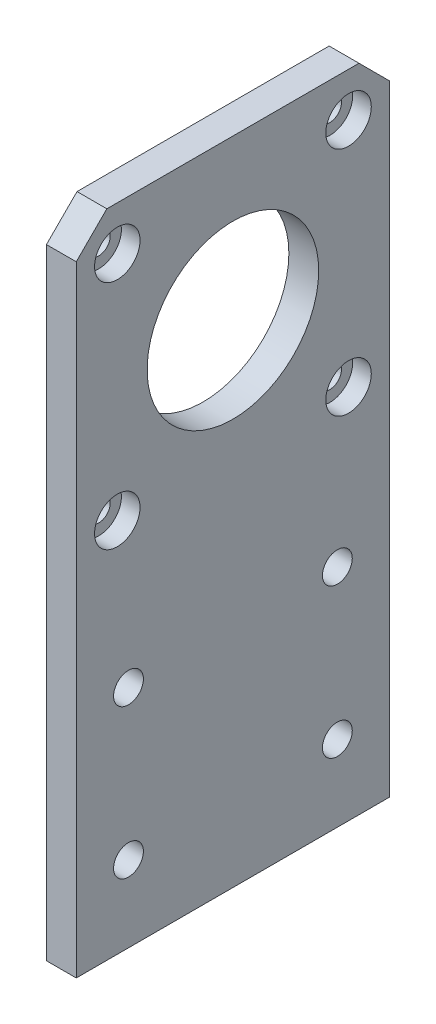
ISO-10303-21;
HEADER;
FILE_DESCRIPTION(('STEP AP214'),'2;1');
FILE_NAME('part.step','',(''),(''),'','','');
FILE_SCHEMA(('AUTOMOTIVE_DESIGN { 1 0 10303 214 1 1 1 1 }'));
ENDSEC;
DATA;
#1=APPLICATION_CONTEXT('core data for automotive mechanical design processes');
#2=APPLICATION_PROTOCOL_DEFINITION('international standard','automotive_design',2000,#1);
#3=PRODUCT_CONTEXT('',#1,'mechanical');
#4=PRODUCT('Part','Part','',(#3));
#5=PRODUCT_RELATED_PRODUCT_CATEGORY('part','',(#4));
#6=PRODUCT_DEFINITION_FORMATION('','',#4);
#7=PRODUCT_DEFINITION_CONTEXT('part definition',#1,'design');
#8=PRODUCT_DEFINITION('design','',#6,#7);
#9=PRODUCT_DEFINITION_SHAPE('','',#8);
#10=(LENGTH_UNIT() NAMED_UNIT(*) SI_UNIT(.MILLI.,.METRE.));
#11=(NAMED_UNIT(*) PLANE_ANGLE_UNIT() SI_UNIT($,.RADIAN.));
#12=(NAMED_UNIT(*) SI_UNIT($,.STERADIAN.) SOLID_ANGLE_UNIT());
#13=UNCERTAINTY_MEASURE_WITH_UNIT(LENGTH_MEASURE(1.E-05),#10,'distance_accuracy_value','');
#14=(GEOMETRIC_REPRESENTATION_CONTEXT(3) GLOBAL_UNCERTAINTY_ASSIGNED_CONTEXT((#13)) GLOBAL_UNIT_ASSIGNED_CONTEXT((#10,
#11,#12)) REPRESENTATION_CONTEXT('',''));
#15=CARTESIAN_POINT('',(0.,0.,0.));
#16=DIRECTION('',(0.,0.,1.));
#17=DIRECTION('',(1.,0.,0.));
#18=AXIS2_PLACEMENT_3D('',#15,#16,#17);
#19=CARTESIAN_POINT('',(0.,6.74500000000001,-15.5));
#20=DIRECTION('',(1.,0.,0.));
#21=DIRECTION('',(0.,0.,-1.));
#22=AXIS2_PLACEMENT_3D('',#19,#20,#21);
#23=CYLINDRICAL_SURFACE('',#22,1.55);
#24=CARTESIAN_POINT('',(0.,6.74500000000001,-15.5));
#25=DIRECTION('',(1.,0.,0.));
#26=DIRECTION('',(0.,0.,-1.));
#27=AXIS2_PLACEMENT_3D('',#24,#25,#26);
#28=CIRCLE('',#27,1.55);
#29=CARTESIAN_POINT('',(0.,6.74500000000001,-17.05));
#30=VERTEX_POINT('',#29);
#31=EDGE_CURVE('E200',#30,#30,#28,.T.);
#32=ORIENTED_EDGE('',*,*,#31,.F.);
#33=EDGE_LOOP('',(#32));
#34=FACE_BOUND('',#33,.T.);
#35=CARTESIAN_POINT('',(1.5,6.74500000000001,-15.5));
#36=DIRECTION('',(1.,0.,0.));
#37=DIRECTION('',(0.,0.,-1.));
#38=AXIS2_PLACEMENT_3D('',#35,#36,#37);
#39=CIRCLE('',#38,1.55);
#40=CARTESIAN_POINT('',(1.5,6.74500000000001,-17.05));
#41=VERTEX_POINT('',#40);
#42=EDGE_CURVE('E36',#41,#41,#39,.F.);
#43=ORIENTED_EDGE('',*,*,#42,.F.);
#44=EDGE_LOOP('',(#43));
#45=FACE_BOUND('',#44,.T.);
#46=ADVANCED_FACE('F32',(#34,#45),#23,.F.);
#47=CARTESIAN_POINT('',(0.,6.74500000000001,15.5));
#48=DIRECTION('',(1.,0.,0.));
#49=DIRECTION('',(0.,0.,-1.));
#50=AXIS2_PLACEMENT_3D('',#47,#48,#49);
#51=CYLINDRICAL_SURFACE('',#50,1.55);
#52=CARTESIAN_POINT('',(0.,6.74500000000001,15.5));
#53=DIRECTION('',(1.,0.,0.));
#54=DIRECTION('',(0.,0.,-1.));
#55=AXIS2_PLACEMENT_3D('',#52,#53,#54);
#56=CIRCLE('',#55,1.55);
#57=CARTESIAN_POINT('',(0.,6.74500000000001,13.95));
#58=VERTEX_POINT('',#57);
#59=EDGE_CURVE('E195',#58,#58,#56,.T.);
#60=ORIENTED_EDGE('',*,*,#59,.F.);
#61=EDGE_LOOP('',(#60));
#62=FACE_BOUND('',#61,.T.);
#63=CARTESIAN_POINT('',(1.5,6.74500000000001,15.5));
#64=DIRECTION('',(1.,0.,0.));
#65=DIRECTION('',(0.,0.,-1.));
#66=AXIS2_PLACEMENT_3D('',#63,#64,#65);
#67=CIRCLE('',#66,1.55);
#68=CARTESIAN_POINT('',(1.5,6.74500000000001,13.95));
#69=VERTEX_POINT('',#68);
#70=EDGE_CURVE('E143',#69,#69,#67,.F.);
#71=ORIENTED_EDGE('',*,*,#70,.F.);
#72=EDGE_LOOP('',(#71));
#73=FACE_BOUND('',#72,.T.);
#74=ADVANCED_FACE('F232',(#62,#73),#51,.F.);
#75=CARTESIAN_POINT('',(0.,37.745,15.5));
#76=DIRECTION('',(1.,0.,0.));
#77=DIRECTION('',(0.,0.,-1.));
#78=AXIS2_PLACEMENT_3D('',#75,#76,#77);
#79=CYLINDRICAL_SURFACE('',#78,1.55);
#80=CARTESIAN_POINT('',(0.,37.745,15.5));
#81=DIRECTION('',(1.,0.,0.));
#82=DIRECTION('',(0.,0.,-1.));
#83=AXIS2_PLACEMENT_3D('',#80,#81,#82);
#84=CIRCLE('',#83,1.55);
#85=CARTESIAN_POINT('',(0.,37.745,13.95));
#86=VERTEX_POINT('',#85);
#87=EDGE_CURVE('E116',#86,#86,#84,.T.);
#88=ORIENTED_EDGE('',*,*,#87,.F.);
#89=EDGE_LOOP('',(#88));
#90=FACE_BOUND('',#89,.T.);
#91=CARTESIAN_POINT('',(1.5,37.745,15.5));
#92=DIRECTION('',(1.,0.,0.));
#93=DIRECTION('',(0.,0.,-1.));
#94=AXIS2_PLACEMENT_3D('',#91,#92,#93);
#95=CIRCLE('',#94,1.55);
#96=CARTESIAN_POINT('',(1.5,37.745,13.95));
#97=VERTEX_POINT('',#96);
#98=EDGE_CURVE('E139',#97,#97,#95,.F.);
#99=ORIENTED_EDGE('',*,*,#98,.F.);
#100=EDGE_LOOP('',(#99));
#101=FACE_BOUND('',#100,.T.);
#102=ADVANCED_FACE('F238',(#90,#101),#79,.F.);
#103=CARTESIAN_POINT('',(0.,37.745,-15.5));
#104=DIRECTION('',(1.,0.,0.));
#105=DIRECTION('',(0.,0.,-1.));
#106=AXIS2_PLACEMENT_3D('',#103,#104,#105);
#107=CYLINDRICAL_SURFACE('',#106,1.55);
#108=CARTESIAN_POINT('',(0.,37.745,-15.5));
#109=DIRECTION('',(1.,0.,0.));
#110=DIRECTION('',(0.,0.,-1.));
#111=AXIS2_PLACEMENT_3D('',#108,#109,#110);
#112=CIRCLE('',#111,1.55);
#113=CARTESIAN_POINT('',(0.,37.745,-17.05));
#114=VERTEX_POINT('',#113);
#115=EDGE_CURVE('E203',#114,#114,#112,.T.);
#116=ORIENTED_EDGE('',*,*,#115,.F.);
#117=EDGE_LOOP('',(#116));
#118=FACE_BOUND('',#117,.T.);
#119=CARTESIAN_POINT('',(1.5,37.745,-15.5));
#120=DIRECTION('',(1.,0.,0.));
#121=DIRECTION('',(0.,0.,-1.));
#122=AXIS2_PLACEMENT_3D('',#119,#120,#121);
#123=CIRCLE('',#122,1.55);
#124=CARTESIAN_POINT('',(1.5,37.745,-17.05));
#125=VERTEX_POINT('',#124);
#126=EDGE_CURVE('E134',#125,#125,#123,.F.);
#127=ORIENTED_EDGE('',*,*,#126,.F.);
#128=EDGE_LOOP('',(#127));
#129=FACE_BOUND('',#128,.T.);
#130=ADVANCED_FACE('F229',(#118,#129),#107,.F.);
#131=CARTESIAN_POINT('',(4.,-43.625,-21.));
#132=DIRECTION('',(0.,0.,1.));
#133=DIRECTION('',(1.,0.,0.));
#134=AXIS2_PLACEMENT_3D('',#131,#132,#133);
#135=PLANE('',#134);
#136=DIRECTION('',(0.,1.,0.));
#137=VECTOR('',#136,1.);
#138=CARTESIAN_POINT('',(0.,-43.625,-21.));
#139=LINE('',#138,#137);
#140=CARTESIAN_POINT('',(0.,-43.625,-21.));
#141=VERTEX_POINT('',#140);
#142=CARTESIAN_POINT('',(0.,39.525,-21.));
#143=VERTEX_POINT('',#142);
#144=EDGE_CURVE('E113',#141,#143,#139,.T.);
#145=ORIENTED_EDGE('',*,*,#144,.T.);
#146=DIRECTION('',(1.,0.,0.));
#147=VECTOR('',#146,1.);
#148=CARTESIAN_POINT('',(4.,39.525,-21.));
#149=LINE('',#148,#147);
#150=CARTESIAN_POINT('',(4.,39.525,-21.));
#151=VERTEX_POINT('',#150);
#152=EDGE_CURVE('E57',#143,#151,#149,.T.);
#153=ORIENTED_EDGE('',*,*,#152,.T.);
#154=DIRECTION('',(0.,1.,0.));
#155=VECTOR('',#154,1.);
#156=CARTESIAN_POINT('',(4.,-43.625,-21.));
#157=LINE('',#156,#155);
#158=CARTESIAN_POINT('',(4.,-43.625,-21.));
#159=VERTEX_POINT('',#158);
#160=EDGE_CURVE('E121',#159,#151,#157,.T.);
#161=ORIENTED_EDGE('',*,*,#160,.F.);
#162=DIRECTION('',(-1.,0.,0.));
#163=VECTOR('',#162,1.);
#164=CARTESIAN_POINT('',(4.,-43.625,-21.));
#165=LINE('',#164,#163);
#166=EDGE_CURVE('E105',#159,#141,#165,.T.);
#167=ORIENTED_EDGE('',*,*,#166,.T.);
#168=EDGE_LOOP('',(#145,#153,#161,#167));
#169=FACE_BOUND('',#168,.T.);
#170=ADVANCED_FACE('F218',(#169),#135,.F.);
#171=CARTESIAN_POINT('',(4.,43.625,21.));
#172=DIRECTION('',(0.,-1.,0.));
#173=DIRECTION('',(0.,0.,-1.));
#174=AXIS2_PLACEMENT_3D('',#171,#172,#173);
#175=PLANE('',#174);
#176=DIRECTION('',(0.,0.,1.));
#177=VECTOR('',#176,1.);
#178=CARTESIAN_POINT('',(4.,43.625,21.));
#179=LINE('',#178,#177);
#180=CARTESIAN_POINT('',(4.,43.625,-16.9));
#181=VERTEX_POINT('',#180);
#182=CARTESIAN_POINT('',(4.,43.625,16.9));
#183=VERTEX_POINT('',#182);
#184=EDGE_CURVE('E95',#181,#183,#179,.T.);
#185=ORIENTED_EDGE('',*,*,#184,.F.);
#186=DIRECTION('',(-1.,0.,0.));
#187=VECTOR('',#186,1.);
#188=CARTESIAN_POINT('',(4.,43.625,-16.9));
#189=LINE('',#188,#187);
#190=CARTESIAN_POINT('',(0.,43.625,-16.9));
#191=VERTEX_POINT('',#190);
#192=EDGE_CURVE('E124',#181,#191,#189,.T.);
#193=ORIENTED_EDGE('',*,*,#192,.T.);
#194=DIRECTION('',(0.,0.,1.));
#195=VECTOR('',#194,1.);
#196=CARTESIAN_POINT('',(0.,43.625,21.));
#197=LINE('',#196,#195);
#198=CARTESIAN_POINT('',(0.,43.625,16.9));
#199=VERTEX_POINT('',#198);
#200=EDGE_CURVE('E115',#191,#199,#197,.T.);
#201=ORIENTED_EDGE('',*,*,#200,.T.);
#202=DIRECTION('',(1.,0.,0.));
#203=VECTOR('',#202,1.);
#204=CARTESIAN_POINT('',(4.,43.625,16.9));
#205=LINE('',#204,#203);
#206=EDGE_CURVE('E104',#199,#183,#205,.T.);
#207=ORIENTED_EDGE('',*,*,#206,.T.);
#208=EDGE_LOOP('',(#185,#193,#201,#207));
#209=FACE_BOUND('',#208,.T.);
#210=ADVANCED_FACE('F221',(#209),#175,.F.);
#211=CARTESIAN_POINT('',(4.,-43.625,21.));
#212=DIRECTION('',(0.,0.,-1.));
#213=DIRECTION('',(-1.,0.,0.));
#214=AXIS2_PLACEMENT_3D('',#211,#212,#213);
#215=PLANE('',#214);
#216=DIRECTION('',(0.,-1.,0.));
#217=VECTOR('',#216,1.);
#218=CARTESIAN_POINT('',(4.,-43.625,21.));
#219=LINE('',#218,#217);
#220=CARTESIAN_POINT('',(4.,39.525,21.));
#221=VERTEX_POINT('',#220);
#222=CARTESIAN_POINT('',(4.,-43.625,21.));
#223=VERTEX_POINT('',#222);
#224=EDGE_CURVE('E87',#221,#223,#219,.T.);
#225=ORIENTED_EDGE('',*,*,#224,.F.);
#226=DIRECTION('',(-1.,0.,0.));
#227=VECTOR('',#226,1.);
#228=CARTESIAN_POINT('',(4.,39.525,21.));
#229=LINE('',#228,#227);
#230=CARTESIAN_POINT('',(0.,39.525,21.));
#231=VERTEX_POINT('',#230);
#232=EDGE_CURVE('E11',#221,#231,#229,.T.);
#233=ORIENTED_EDGE('',*,*,#232,.T.);
#234=DIRECTION('',(0.,-1.,0.));
#235=VECTOR('',#234,1.);
#236=CARTESIAN_POINT('',(0.,-43.625,21.));
#237=LINE('',#236,#235);
#238=CARTESIAN_POINT('',(0.,-43.625,21.));
#239=VERTEX_POINT('',#238);
#240=EDGE_CURVE('E101',#231,#239,#237,.T.);
#241=ORIENTED_EDGE('',*,*,#240,.T.);
#242=DIRECTION('',(-1.,0.,0.));
#243=VECTOR('',#242,1.);
#244=CARTESIAN_POINT('',(4.,-43.625,21.));
#245=LINE('',#244,#243);
#246=EDGE_CURVE('E98',#223,#239,#245,.T.);
#247=ORIENTED_EDGE('',*,*,#246,.F.);
#248=EDGE_LOOP('',(#225,#233,#241,#247));
#249=FACE_BOUND('',#248,.T.);
#250=ADVANCED_FACE('F99',(#249),#215,.F.);
#251=CARTESIAN_POINT('',(4.,-43.625,21.));
#252=DIRECTION('',(0.,1.,0.));
#253=DIRECTION('',(0.,0.,1.));
#254=AXIS2_PLACEMENT_3D('',#251,#252,#253);
#255=PLANE('',#254);
#256=DIRECTION('',(0.,0.,-1.));
#257=VECTOR('',#256,1.);
#258=CARTESIAN_POINT('',(0.,-43.625,21.));
#259=LINE('',#258,#257);
#260=EDGE_CURVE('E120',#239,#141,#259,.T.);
#261=ORIENTED_EDGE('',*,*,#260,.T.);
#262=ORIENTED_EDGE('',*,*,#166,.F.);
#263=DIRECTION('',(0.,0.,-1.));
#264=VECTOR('',#263,1.);
#265=CARTESIAN_POINT('',(4.,-43.625,21.));
#266=LINE('',#265,#264);
#267=EDGE_CURVE('E91',#223,#159,#266,.T.);
#268=ORIENTED_EDGE('',*,*,#267,.F.);
#269=ORIENTED_EDGE('',*,*,#246,.T.);
#270=EDGE_LOOP('',(#261,#262,#268,#269));
#271=FACE_BOUND('',#270,.T.);
#272=ADVANCED_FACE('F107',(#271),#255,.F.);
#273=CARTESIAN_POINT('',(4.,0.,0.));
#274=DIRECTION('',(-1.,0.,0.));
#275=DIRECTION('',(0.,0.,1.));
#276=AXIS2_PLACEMENT_3D('',#273,#274,#275);
#277=PLANE('',#276);
#278=CARTESIAN_POINT('',(4.,6.74500000000001,-15.5));
#279=DIRECTION('',(1.,0.,0.));
#280=DIRECTION('',(0.,0.,-1.));
#281=AXIS2_PLACEMENT_3D('',#278,#279,#280);
#282=CIRCLE('',#281,3.05);
#283=CARTESIAN_POINT('',(4.,6.74500000000001,-18.55));
#284=VERTEX_POINT('',#283);
#285=EDGE_CURVE('E159',#284,#284,#282,.T.);
#286=ORIENTED_EDGE('',*,*,#285,.F.);
#287=EDGE_LOOP('',(#286));
#288=FACE_BOUND('',#287,.T.);
#289=CARTESIAN_POINT('',(4.,6.74500000000001,15.5));
#290=DIRECTION('',(1.,0.,0.));
#291=DIRECTION('',(0.,0.,-1.));
#292=AXIS2_PLACEMENT_3D('',#289,#290,#291);
#293=CIRCLE('',#292,3.05);
#294=CARTESIAN_POINT('',(4.,6.74500000000001,12.45));
#295=VERTEX_POINT('',#294);
#296=EDGE_CURVE('E152',#295,#295,#293,.T.);
#297=ORIENTED_EDGE('',*,*,#296,.F.);
#298=EDGE_LOOP('',(#297));
#299=FACE_BOUND('',#298,.T.);
#300=CARTESIAN_POINT('',(4.,37.745,15.5));
#301=DIRECTION('',(1.,0.,0.));
#302=DIRECTION('',(0.,0.,-1.));
#303=AXIS2_PLACEMENT_3D('',#300,#301,#302);
#304=CIRCLE('',#303,3.05);
#305=CARTESIAN_POINT('',(4.,37.745,12.45));
#306=VERTEX_POINT('',#305);
#307=EDGE_CURVE('E145',#306,#306,#304,.T.);
#308=ORIENTED_EDGE('',*,*,#307,.F.);
#309=EDGE_LOOP('',(#308));
#310=FACE_BOUND('',#309,.T.);
#311=CARTESIAN_POINT('',(4.,37.745,-15.5));
#312=DIRECTION('',(1.,0.,0.));
#313=DIRECTION('',(0.,0.,-1.));
#314=AXIS2_PLACEMENT_3D('',#311,#312,#313);
#315=CIRCLE('',#314,3.05);
#316=CARTESIAN_POINT('',(4.,37.745,-18.55));
#317=VERTEX_POINT('',#316);
#318=EDGE_CURVE('E141',#317,#317,#315,.T.);
#319=ORIENTED_EDGE('',*,*,#318,.F.);
#320=EDGE_LOOP('',(#319));
#321=FACE_BOUND('',#320,.T.);
#322=CARTESIAN_POINT('',(4.,-33.405,-14.));
#323=DIRECTION('',(1.,0.,0.));
#324=DIRECTION('',(0.,0.,-1.));
#325=AXIS2_PLACEMENT_3D('',#322,#323,#324);
#326=CIRCLE('',#325,2.00000000000001);
#327=CARTESIAN_POINT('',(4.,-33.405,-16.));
#328=VERTEX_POINT('',#327);
#329=EDGE_CURVE('E137',#328,#328,#326,.T.);
#330=ORIENTED_EDGE('',*,*,#329,.F.);
#331=EDGE_LOOP('',(#330));
#332=FACE_BOUND('',#331,.T.);
#333=CARTESIAN_POINT('',(4.,-33.405,14.));
#334=DIRECTION('',(1.,0.,0.));
#335=DIRECTION('',(0.,0.,-1.));
#336=AXIS2_PLACEMENT_3D('',#333,#334,#335);
#337=CIRCLE('',#336,2.);
#338=CARTESIAN_POINT('',(4.,-33.405,12.));
#339=VERTEX_POINT('',#338);
#340=EDGE_CURVE('E171',#339,#339,#337,.T.);
#341=ORIENTED_EDGE('',*,*,#340,.F.);
#342=EDGE_LOOP('',(#341));
#343=FACE_BOUND('',#342,.T.);
#344=CARTESIAN_POINT('',(4.,-13.405,-14.));
#345=DIRECTION('',(1.,0.,0.));
#346=DIRECTION('',(0.,0.,-1.));
#347=AXIS2_PLACEMENT_3D('',#344,#345,#346);
#348=CIRCLE('',#347,2.00000000000002);
#349=CARTESIAN_POINT('',(4.,-13.405,-16.));
#350=VERTEX_POINT('',#349);
#351=EDGE_CURVE('E177',#350,#350,#348,.T.);
#352=ORIENTED_EDGE('',*,*,#351,.F.);
#353=EDGE_LOOP('',(#352));
#354=FACE_BOUND('',#353,.T.);
#355=CARTESIAN_POINT('',(4.,-13.405,14.));
#356=DIRECTION('',(1.,0.,0.));
#357=DIRECTION('',(0.,0.,-1.));
#358=AXIS2_PLACEMENT_3D('',#355,#356,#357);
#359=CIRCLE('',#358,2.);
#360=CARTESIAN_POINT('',(4.,-13.405,12.));
#361=VERTEX_POINT('',#360);
#362=EDGE_CURVE('E183',#361,#361,#359,.T.);
#363=ORIENTED_EDGE('',*,*,#362,.F.);
#364=EDGE_LOOP('',(#363));
#365=FACE_BOUND('',#364,.T.);
#366=CARTESIAN_POINT('',(4.,22.245,0.));
#367=DIRECTION('',(1.,0.,0.));
#368=DIRECTION('',(0.,0.,-1.));
#369=AXIS2_PLACEMENT_3D('',#366,#367,#368);
#370=CIRCLE('',#369,11.5);
#371=CARTESIAN_POINT('',(4.,22.245,-11.5));
#372=VERTEX_POINT('',#371);
#373=EDGE_CURVE('E189',#372,#372,#370,.T.);
#374=ORIENTED_EDGE('',*,*,#373,.F.);
#375=EDGE_LOOP('',(#374));
#376=FACE_BOUND('',#375,.T.);
#377=ORIENTED_EDGE('',*,*,#160,.T.);
#378=DIRECTION('',(0.,-0.707106781186549,-0.707106781186546));
#379=VECTOR('',#378,1.);
#380=CARTESIAN_POINT('',(4.,43.625,-16.9));
#381=LINE('',#380,#379);
#382=EDGE_CURVE('E41',#151,#181,#381,.F.);
#383=ORIENTED_EDGE('',*,*,#382,.T.);
#384=ORIENTED_EDGE('',*,*,#184,.T.);
#385=DIRECTION('',(0.,0.707106781186546,-0.707106781186549));
#386=VECTOR('',#385,1.);
#387=CARTESIAN_POINT('',(4.,39.525,21.));
#388=LINE('',#387,#386);
#389=EDGE_CURVE('E49',#183,#221,#388,.F.);
#390=ORIENTED_EDGE('',*,*,#389,.T.);
#391=ORIENTED_EDGE('',*,*,#224,.T.);
#392=ORIENTED_EDGE('',*,*,#267,.T.);
#393=EDGE_LOOP('',(#377,#383,#384,#390,#391,#392));
#394=FACE_BOUND('',#393,.T.);
#395=ADVANCED_FACE('F89',(#288,#299,#310,#321,#332,#343,#354,#365,#376,#394),#277,.F.);
#396=CARTESIAN_POINT('',(0.,0.,0.));
#397=DIRECTION('',(-1.,0.,0.));
#398=DIRECTION('',(0.,0.,1.));
#399=AXIS2_PLACEMENT_3D('',#396,#397,#398);
#400=PLANE('',#399);
#401=CARTESIAN_POINT('',(0.,-33.405,-14.));
#402=DIRECTION('',(1.,0.,0.));
#403=DIRECTION('',(0.,0.,-1.));
#404=AXIS2_PLACEMENT_3D('',#401,#402,#403);
#405=CIRCLE('',#404,2.00000000000001);
#406=CARTESIAN_POINT('',(0.,-33.405,-16.));
#407=VERTEX_POINT('',#406);
#408=EDGE_CURVE('E168',#407,#407,#405,.T.);
#409=ORIENTED_EDGE('',*,*,#408,.T.);
#410=EDGE_LOOP('',(#409));
#411=FACE_BOUND('',#410,.T.);
#412=CARTESIAN_POINT('',(0.,-33.405,14.));
#413=DIRECTION('',(1.,0.,0.));
#414=DIRECTION('',(0.,0.,-1.));
#415=AXIS2_PLACEMENT_3D('',#412,#413,#414);
#416=CIRCLE('',#415,2.);
#417=CARTESIAN_POINT('',(0.,-33.405,12.));
#418=VERTEX_POINT('',#417);
#419=EDGE_CURVE('E174',#418,#418,#416,.T.);
#420=ORIENTED_EDGE('',*,*,#419,.T.);
#421=EDGE_LOOP('',(#420));
#422=FACE_BOUND('',#421,.T.);
#423=CARTESIAN_POINT('',(0.,-13.405,-14.));
#424=DIRECTION('',(1.,0.,0.));
#425=DIRECTION('',(0.,0.,-1.));
#426=AXIS2_PLACEMENT_3D('',#423,#424,#425);
#427=CIRCLE('',#426,2.00000000000002);
#428=CARTESIAN_POINT('',(0.,-13.405,-16.));
#429=VERTEX_POINT('',#428);
#430=EDGE_CURVE('E180',#429,#429,#427,.T.);
#431=ORIENTED_EDGE('',*,*,#430,.T.);
#432=EDGE_LOOP('',(#431));
#433=FACE_BOUND('',#432,.T.);
#434=CARTESIAN_POINT('',(0.,-13.405,14.));
#435=DIRECTION('',(1.,0.,0.));
#436=DIRECTION('',(0.,0.,-1.));
#437=AXIS2_PLACEMENT_3D('',#434,#435,#436);
#438=CIRCLE('',#437,2.);
#439=CARTESIAN_POINT('',(0.,-13.405,12.));
#440=VERTEX_POINT('',#439);
#441=EDGE_CURVE('E186',#440,#440,#438,.T.);
#442=ORIENTED_EDGE('',*,*,#441,.T.);
#443=EDGE_LOOP('',(#442));
#444=FACE_BOUND('',#443,.T.);
#445=CARTESIAN_POINT('',(0.,22.245,0.));
#446=DIRECTION('',(1.,0.,0.));
#447=DIRECTION('',(0.,0.,-1.));
#448=AXIS2_PLACEMENT_3D('',#445,#446,#447);
#449=CIRCLE('',#448,11.5);
#450=CARTESIAN_POINT('',(0.,22.245,-11.5));
#451=VERTEX_POINT('',#450);
#452=EDGE_CURVE('E192',#451,#451,#449,.T.);
#453=ORIENTED_EDGE('',*,*,#452,.T.);
#454=EDGE_LOOP('',(#453));
#455=FACE_BOUND('',#454,.T.);
#456=ORIENTED_EDGE('',*,*,#59,.T.);
#457=EDGE_LOOP('',(#456));
#458=FACE_BOUND('',#457,.T.);
#459=ORIENTED_EDGE('',*,*,#31,.T.);
#460=EDGE_LOOP('',(#459));
#461=FACE_BOUND('',#460,.T.);
#462=ORIENTED_EDGE('',*,*,#115,.T.);
#463=EDGE_LOOP('',(#462));
#464=FACE_BOUND('',#463,.T.);
#465=ORIENTED_EDGE('',*,*,#87,.T.);
#466=EDGE_LOOP('',(#465));
#467=FACE_BOUND('',#466,.T.);
#468=ORIENTED_EDGE('',*,*,#200,.F.);
#469=DIRECTION('',(0.,0.707106781186549,0.707106781186546));
#470=VECTOR('',#469,1.);
#471=CARTESIAN_POINT('',(0.,30.2624999999999,-30.2625));
#472=LINE('',#471,#470);
#473=EDGE_CURVE('E129',#191,#143,#472,.F.);
#474=ORIENTED_EDGE('',*,*,#473,.T.);
#475=ORIENTED_EDGE('',*,*,#144,.F.);
#476=ORIENTED_EDGE('',*,*,#260,.F.);
#477=ORIENTED_EDGE('',*,*,#240,.F.);
#478=DIRECTION('',(0.,-0.707106781186546,0.707106781186549));
#479=VECTOR('',#478,1.);
#480=CARTESIAN_POINT('',(0.,30.2625000000001,30.2625));
#481=LINE('',#480,#479);
#482=EDGE_CURVE('E127',#231,#199,#481,.F.);
#483=ORIENTED_EDGE('',*,*,#482,.T.);
#484=EDGE_LOOP('',(#468,#474,#475,#476,#477,#483));
#485=FACE_BOUND('',#484,.T.);
#486=ADVANCED_FACE('F216',(#411,#422,#433,#444,#455,#458,#461,#464,#467,#485),#400,.T.);
#487=CARTESIAN_POINT('',(0.,22.245,0.));
#488=DIRECTION('',(1.,0.,0.));
#489=DIRECTION('',(0.,0.,-1.));
#490=AXIS2_PLACEMENT_3D('',#487,#488,#489);
#491=CYLINDRICAL_SURFACE('',#490,11.5);
#492=ORIENTED_EDGE('',*,*,#452,.F.);
#493=EDGE_LOOP('',(#492));
#494=FACE_BOUND('',#493,.T.);
#495=ORIENTED_EDGE('',*,*,#373,.T.);
#496=EDGE_LOOP('',(#495));
#497=FACE_BOUND('',#496,.T.);
#498=ADVANCED_FACE('F256',(#494,#497),#491,.F.);
#499=CARTESIAN_POINT('',(0.,-13.405,14.));
#500=DIRECTION('',(1.,0.,0.));
#501=DIRECTION('',(0.,0.,-1.));
#502=AXIS2_PLACEMENT_3D('',#499,#500,#501);
#503=CYLINDRICAL_SURFACE('',#502,2.);
#504=ORIENTED_EDGE('',*,*,#441,.F.);
#505=EDGE_LOOP('',(#504));
#506=FACE_BOUND('',#505,.T.);
#507=ORIENTED_EDGE('',*,*,#362,.T.);
#508=EDGE_LOOP('',(#507));
#509=FACE_BOUND('',#508,.T.);
#510=ADVANCED_FACE('F280',(#506,#509),#503,.F.);
#511=CARTESIAN_POINT('',(0.,-13.405,-14.));
#512=DIRECTION('',(1.,0.,0.));
#513=DIRECTION('',(0.,0.,-1.));
#514=AXIS2_PLACEMENT_3D('',#511,#512,#513);
#515=CYLINDRICAL_SURFACE('',#514,2.00000000000002);
#516=ORIENTED_EDGE('',*,*,#430,.F.);
#517=EDGE_LOOP('',(#516));
#518=FACE_BOUND('',#517,.T.);
#519=ORIENTED_EDGE('',*,*,#351,.T.);
#520=EDGE_LOOP('',(#519));
#521=FACE_BOUND('',#520,.T.);
#522=ADVANCED_FACE('F287',(#518,#521),#515,.F.);
#523=CARTESIAN_POINT('',(0.,-33.405,14.));
#524=DIRECTION('',(1.,0.,0.));
#525=DIRECTION('',(0.,0.,-1.));
#526=AXIS2_PLACEMENT_3D('',#523,#524,#525);
#527=CYLINDRICAL_SURFACE('',#526,2.);
#528=ORIENTED_EDGE('',*,*,#419,.F.);
#529=EDGE_LOOP('',(#528));
#530=FACE_BOUND('',#529,.T.);
#531=ORIENTED_EDGE('',*,*,#340,.T.);
#532=EDGE_LOOP('',(#531));
#533=FACE_BOUND('',#532,.T.);
#534=ADVANCED_FACE('F295',(#530,#533),#527,.F.);
#535=CARTESIAN_POINT('',(0.,-33.405,-14.));
#536=DIRECTION('',(1.,0.,0.));
#537=DIRECTION('',(0.,0.,-1.));
#538=AXIS2_PLACEMENT_3D('',#535,#536,#537);
#539=CYLINDRICAL_SURFACE('',#538,2.00000000000001);
#540=ORIENTED_EDGE('',*,*,#408,.F.);
#541=EDGE_LOOP('',(#540));
#542=FACE_BOUND('',#541,.T.);
#543=ORIENTED_EDGE('',*,*,#329,.T.);
#544=EDGE_LOOP('',(#543));
#545=FACE_BOUND('',#544,.T.);
#546=ADVANCED_FACE('F303',(#542,#545),#539,.F.);
#547=CARTESIAN_POINT('',(4.,43.625,-16.9));
#548=DIRECTION('',(0.,-0.707106781186546,0.707106781186549));
#549=DIRECTION('',(-1.,0.,0.));
#550=AXIS2_PLACEMENT_3D('',#547,#548,#549);
#551=PLANE('',#550);
#552=ORIENTED_EDGE('',*,*,#382,.F.);
#553=ORIENTED_EDGE('',*,*,#152,.F.);
#554=ORIENTED_EDGE('',*,*,#473,.F.);
#555=ORIENTED_EDGE('',*,*,#192,.F.);
#556=EDGE_LOOP('',(#552,#553,#554,#555));
#557=FACE_BOUND('',#556,.T.);
#558=ADVANCED_FACE('F220',(#557),#551,.F.);
#559=CARTESIAN_POINT('',(4.,39.525,21.));
#560=DIRECTION('',(0.,-0.707106781186549,-0.707106781186546));
#561=DIRECTION('',(-1.,0.,0.));
#562=AXIS2_PLACEMENT_3D('',#559,#560,#561);
#563=PLANE('',#562);
#564=ORIENTED_EDGE('',*,*,#389,.F.);
#565=ORIENTED_EDGE('',*,*,#206,.F.);
#566=ORIENTED_EDGE('',*,*,#482,.F.);
#567=ORIENTED_EDGE('',*,*,#232,.F.);
#568=EDGE_LOOP('',(#564,#565,#566,#567));
#569=FACE_BOUND('',#568,.T.);
#570=ADVANCED_FACE('F34',(#569),#563,.F.);
#571=CARTESIAN_POINT('',(1.5,37.745,-15.5));
#572=DIRECTION('',(1.,0.,0.));
#573=DIRECTION('',(0.,0.,-1.));
#574=AXIS2_PLACEMENT_3D('',#571,#572,#573);
#575=PLANE('',#574);
#576=CARTESIAN_POINT('',(1.5,37.745,-15.5));
#577=DIRECTION('',(1.,0.,0.));
#578=DIRECTION('',(0.,0.,-1.));
#579=AXIS2_PLACEMENT_3D('',#576,#577,#578);
#580=CIRCLE('',#579,3.05);
#581=CARTESIAN_POINT('',(1.5,37.745,-18.55));
#582=VERTEX_POINT('',#581);
#583=EDGE_CURVE('E138',#582,#582,#580,.T.);
#584=ORIENTED_EDGE('',*,*,#583,.T.);
#585=EDGE_LOOP('',(#584));
#586=FACE_BOUND('',#585,.T.);
#587=ORIENTED_EDGE('',*,*,#126,.T.);
#588=EDGE_LOOP('',(#587));
#589=FACE_BOUND('',#588,.T.);
#590=ADVANCED_FACE('F323',(#586,#589),#575,.T.);
#591=CARTESIAN_POINT('',(1.5,37.745,-15.5));
#592=DIRECTION('',(1.,0.,0.));
#593=DIRECTION('',(0.,0.,-1.));
#594=AXIS2_PLACEMENT_3D('',#591,#592,#593);
#595=CYLINDRICAL_SURFACE('',#594,3.05);
#596=ORIENTED_EDGE('',*,*,#583,.F.);
#597=EDGE_LOOP('',(#596));
#598=FACE_BOUND('',#597,.T.);
#599=ORIENTED_EDGE('',*,*,#318,.T.);
#600=EDGE_LOOP('',(#599));
#601=FACE_BOUND('',#600,.T.);
#602=ADVANCED_FACE('F328',(#598,#601),#595,.F.);
#603=CARTESIAN_POINT('',(1.5,37.745,15.5));
#604=DIRECTION('',(1.,0.,0.));
#605=DIRECTION('',(0.,0.,-1.));
#606=AXIS2_PLACEMENT_3D('',#603,#604,#605);
#607=PLANE('',#606);
#608=CARTESIAN_POINT('',(1.5,37.745,15.5));
#609=DIRECTION('',(1.,0.,0.));
#610=DIRECTION('',(0.,0.,-1.));
#611=AXIS2_PLACEMENT_3D('',#608,#609,#610);
#612=CIRCLE('',#611,3.05);
#613=CARTESIAN_POINT('',(1.5,37.745,12.45));
#614=VERTEX_POINT('',#613);
#615=EDGE_CURVE('E142',#614,#614,#612,.T.);
#616=ORIENTED_EDGE('',*,*,#615,.T.);
#617=EDGE_LOOP('',(#616));
#618=FACE_BOUND('',#617,.T.);
#619=ORIENTED_EDGE('',*,*,#98,.T.);
#620=EDGE_LOOP('',(#619));
#621=FACE_BOUND('',#620,.T.);
#622=ADVANCED_FACE('F336',(#618,#621),#607,.T.);
#623=CARTESIAN_POINT('',(1.5,37.745,15.5));
#624=DIRECTION('',(1.,0.,0.));
#625=DIRECTION('',(0.,0.,-1.));
#626=AXIS2_PLACEMENT_3D('',#623,#624,#625);
#627=CYLINDRICAL_SURFACE('',#626,3.05);
#628=ORIENTED_EDGE('',*,*,#615,.F.);
#629=EDGE_LOOP('',(#628));
#630=FACE_BOUND('',#629,.T.);
#631=ORIENTED_EDGE('',*,*,#307,.T.);
#632=EDGE_LOOP('',(#631));
#633=FACE_BOUND('',#632,.T.);
#634=ADVANCED_FACE('F344',(#630,#633),#627,.F.);
#635=CARTESIAN_POINT('',(1.5,6.74500000000001,15.5));
#636=DIRECTION('',(1.,0.,0.));
#637=DIRECTION('',(0.,0.,-1.));
#638=AXIS2_PLACEMENT_3D('',#635,#636,#637);
#639=PLANE('',#638);
#640=CARTESIAN_POINT('',(1.5,6.74500000000001,15.5));
#641=DIRECTION('',(1.,0.,0.));
#642=DIRECTION('',(0.,0.,-1.));
#643=AXIS2_PLACEMENT_3D('',#640,#641,#642);
#644=CIRCLE('',#643,3.05);
#645=CARTESIAN_POINT('',(1.5,6.74500000000001,12.45));
#646=VERTEX_POINT('',#645);
#647=EDGE_CURVE('E146',#646,#646,#644,.T.);
#648=ORIENTED_EDGE('',*,*,#647,.T.);
#649=EDGE_LOOP('',(#648));
#650=FACE_BOUND('',#649,.T.);
#651=ORIENTED_EDGE('',*,*,#70,.T.);
#652=EDGE_LOOP('',(#651));
#653=FACE_BOUND('',#652,.T.);
#654=ADVANCED_FACE('F352',(#650,#653),#639,.T.);
#655=CARTESIAN_POINT('',(1.5,6.74500000000001,15.5));
#656=DIRECTION('',(1.,0.,0.));
#657=DIRECTION('',(0.,0.,-1.));
#658=AXIS2_PLACEMENT_3D('',#655,#656,#657);
#659=CYLINDRICAL_SURFACE('',#658,3.05);
#660=ORIENTED_EDGE('',*,*,#647,.F.);
#661=EDGE_LOOP('',(#660));
#662=FACE_BOUND('',#661,.T.);
#663=ORIENTED_EDGE('',*,*,#296,.T.);
#664=EDGE_LOOP('',(#663));
#665=FACE_BOUND('',#664,.T.);
#666=ADVANCED_FACE('F360',(#662,#665),#659,.F.);
#667=CARTESIAN_POINT('',(1.5,6.74500000000001,-15.5));
#668=DIRECTION('',(1.,0.,0.));
#669=DIRECTION('',(0.,0.,-1.));
#670=AXIS2_PLACEMENT_3D('',#667,#668,#669);
#671=PLANE('',#670);
#672=CARTESIAN_POINT('',(1.5,6.74500000000001,-15.5));
#673=DIRECTION('',(1.,0.,0.));
#674=DIRECTION('',(0.,0.,-1.));
#675=AXIS2_PLACEMENT_3D('',#672,#673,#674);
#676=CIRCLE('',#675,3.05);
#677=CARTESIAN_POINT('',(1.5,6.74500000000001,-18.55));
#678=VERTEX_POINT('',#677);
#679=EDGE_CURVE('E459',#678,#678,#676,.T.);
#680=ORIENTED_EDGE('',*,*,#679,.T.);
#681=EDGE_LOOP('',(#680));
#682=FACE_BOUND('',#681,.T.);
#683=ORIENTED_EDGE('',*,*,#42,.T.);
#684=EDGE_LOOP('',(#683));
#685=FACE_BOUND('',#684,.T.);
#686=ADVANCED_FACE('F367',(#682,#685),#671,.T.);
#687=CARTESIAN_POINT('',(1.5,6.74500000000001,-15.5));
#688=DIRECTION('',(1.,0.,0.));
#689=DIRECTION('',(0.,0.,-1.));
#690=AXIS2_PLACEMENT_3D('',#687,#688,#689);
#691=CYLINDRICAL_SURFACE('',#690,3.05);
#692=ORIENTED_EDGE('',*,*,#679,.F.);
#693=EDGE_LOOP('',(#692));
#694=FACE_BOUND('',#693,.T.);
#695=ORIENTED_EDGE('',*,*,#285,.T.);
#696=EDGE_LOOP('',(#695));
#697=FACE_BOUND('',#696,.T.);
#698=ADVANCED_FACE('F375',(#694,#697),#691,.F.);
#699=CLOSED_SHELL('',(#46,#74,#102,#130,#170,#210,#250,#272,#395,#486,#498,#510,#522,#534,#546,
#558,#570,#590,#602,#622,#634,#654,#666,#686,#698));
#700=MANIFOLD_SOLID_BREP('B2',#699);
#701=ADVANCED_BREP_SHAPE_REPRESENTATION('',(#18,#700),#14);
#702=SHAPE_DEFINITION_REPRESENTATION(#9,#701);
ENDSEC;
END-ISO-10303-21;
